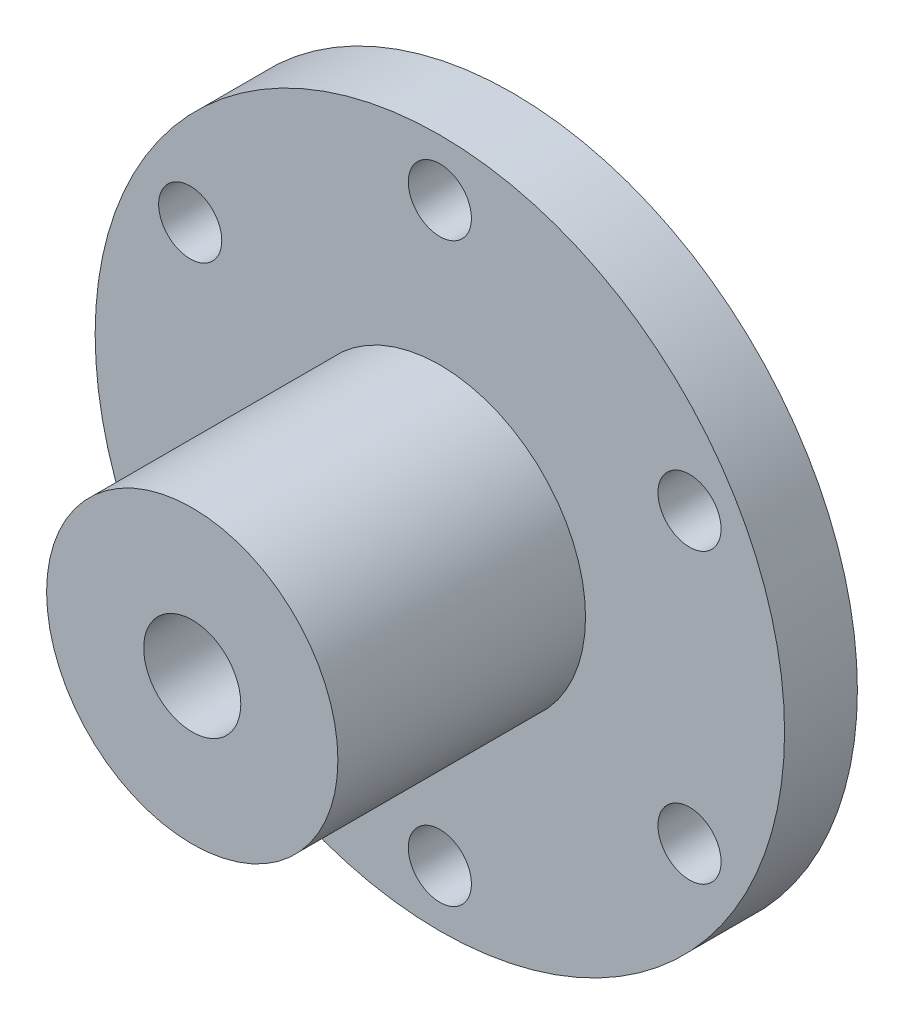
ISO-10303-21;
HEADER;
FILE_DESCRIPTION(('STEP AP214'),'2;1');
FILE_NAME('part.step','',(''),(''),'','','');
FILE_SCHEMA(('AUTOMOTIVE_DESIGN { 1 0 10303 214 1 1 1 1 }'));
ENDSEC;
DATA;
#1=APPLICATION_CONTEXT('core data for automotive mechanical design processes');
#2=APPLICATION_PROTOCOL_DEFINITION('international standard','automotive_design',2000,#1);
#3=PRODUCT_CONTEXT('',#1,'mechanical');
#4=PRODUCT('Part','Part','',(#3));
#5=PRODUCT_RELATED_PRODUCT_CATEGORY('part','',(#4));
#6=PRODUCT_DEFINITION_FORMATION('','',#4);
#7=PRODUCT_DEFINITION_CONTEXT('part definition',#1,'design');
#8=PRODUCT_DEFINITION('design','',#6,#7);
#9=PRODUCT_DEFINITION_SHAPE('','',#8);
#10=(LENGTH_UNIT() NAMED_UNIT(*) SI_UNIT(.MILLI.,.METRE.));
#11=(NAMED_UNIT(*) PLANE_ANGLE_UNIT() SI_UNIT($,.RADIAN.));
#12=(NAMED_UNIT(*) SI_UNIT($,.STERADIAN.) SOLID_ANGLE_UNIT());
#13=UNCERTAINTY_MEASURE_WITH_UNIT(LENGTH_MEASURE(1.E-05),#10,'distance_accuracy_value','');
#14=(GEOMETRIC_REPRESENTATION_CONTEXT(3) GLOBAL_UNCERTAINTY_ASSIGNED_CONTEXT((#13)) GLOBAL_UNIT_ASSIGNED_CONTEXT((#10,
#11,#12)) REPRESENTATION_CONTEXT('',''));
#15=CARTESIAN_POINT('',(0.,0.,0.));
#16=DIRECTION('',(0.,0.,1.));
#17=DIRECTION('',(1.,0.,0.));
#18=AXIS2_PLACEMENT_3D('',#15,#16,#17);
#19=CARTESIAN_POINT('',(0.,0.,6.));
#20=DIRECTION('',(0.,0.,1.));
#21=DIRECTION('',(1.,0.,0.));
#22=AXIS2_PLACEMENT_3D('',#19,#20,#21);
#23=PLANE('',#22);
#24=CARTESIAN_POINT('',(-20.5681033398798,11.8749999999988,6.));
#25=DIRECTION('',(0.,0.,1.));
#26=DIRECTION('',(1.,0.,0.));
#27=AXIS2_PLACEMENT_3D('',#24,#25,#26);
#28=CIRCLE('',#27,2.60000000000127);
#29=CARTESIAN_POINT('',(-17.9681033398785,11.8749999999988,6.));
#30=VERTEX_POINT('',#29);
#31=EDGE_CURVE('E92',#30,#30,#28,.T.);
#32=ORIENTED_EDGE('',*,*,#31,.F.);
#33=EDGE_LOOP('',(#32));
#34=FACE_BOUND('',#33,.T.);
#35=CARTESIAN_POINT('',(2.69133678744446E-12,-23.75,6.));
#36=DIRECTION('',(0.,0.,1.));
#37=DIRECTION('',(1.,0.,0.));
#38=AXIS2_PLACEMENT_3D('',#35,#36,#37);
#39=CIRCLE('',#38,2.60000000000273);
#40=CARTESIAN_POINT('',(2.60000000000542,-23.75,6.));
#41=VERTEX_POINT('',#40);
#42=EDGE_CURVE('E76',#41,#41,#39,.T.);
#43=ORIENTED_EDGE('',*,*,#42,.F.);
#44=EDGE_LOOP('',(#43));
#45=FACE_BOUND('',#44,.T.);
#46=CARTESIAN_POINT('',(20.5681033398811,11.8750000000012,6.));
#47=DIRECTION('',(0.,0.,1.));
#48=DIRECTION('',(1.,0.,0.));
#49=AXIS2_PLACEMENT_3D('',#46,#47,#48);
#50=CIRCLE('',#49,2.60000000000036);
#51=CARTESIAN_POINT('',(23.1681033398814,11.8750000000012,6.));
#52=VERTEX_POINT('',#51);
#53=EDGE_CURVE('E63',#52,#52,#50,.T.);
#54=ORIENTED_EDGE('',*,*,#53,.F.);
#55=EDGE_LOOP('',(#54));
#56=FACE_BOUND('',#55,.T.);
#57=CARTESIAN_POINT('',(0.,23.75,6.));
#58=DIRECTION('',(0.,0.,1.));
#59=DIRECTION('',(1.,0.,0.));
#60=AXIS2_PLACEMENT_3D('',#57,#58,#59);
#61=CIRCLE('',#60,2.6);
#62=CARTESIAN_POINT('',(2.6,23.75,6.));
#63=VERTEX_POINT('',#62);
#64=EDGE_CURVE('E50',#63,#63,#61,.T.);
#65=ORIENTED_EDGE('',*,*,#64,.F.);
#66=EDGE_LOOP('',(#65));
#67=FACE_BOUND('',#66,.T.);
#68=CARTESIAN_POINT('',(0.,0.,6.));
#69=DIRECTION('',(0.,0.,1.));
#70=DIRECTION('',(1.,0.,0.));
#71=AXIS2_PLACEMENT_3D('',#68,#69,#70);
#72=CIRCLE('',#71,28.4);
#73=CARTESIAN_POINT('',(28.4,0.,6.));
#74=VERTEX_POINT('',#73);
#75=EDGE_CURVE('E10',#74,#74,#72,.T.);
#76=ORIENTED_EDGE('',*,*,#75,.T.);
#77=EDGE_LOOP('',(#76));
#78=FACE_BOUND('',#77,.T.);
#79=CARTESIAN_POINT('',(20.5681033398824,-11.8749999999988,6.));
#80=DIRECTION('',(0.,0.,1.));
#81=DIRECTION('',(1.,0.,0.));
#82=AXIS2_PLACEMENT_3D('',#79,#80,#81);
#83=CIRCLE('',#82,2.6000000000017);
#84=CARTESIAN_POINT('',(23.1681033398841,-11.8749999999988,6.));
#85=VERTEX_POINT('',#84);
#86=EDGE_CURVE('E68',#85,#85,#83,.T.);
#87=ORIENTED_EDGE('',*,*,#86,.F.);
#88=EDGE_LOOP('',(#87));
#89=FACE_BOUND('',#88,.T.);
#90=CARTESIAN_POINT('',(-20.5681033398784,-11.8750000000012,6.));
#91=DIRECTION('',(0.,0.,1.));
#92=DIRECTION('',(1.,0.,0.));
#93=AXIS2_PLACEMENT_3D('',#90,#91,#92);
#94=CIRCLE('',#93,2.60000000000249);
#95=CARTESIAN_POINT('',(-17.9681033398759,-11.8750000000012,6.));
#96=VERTEX_POINT('',#95);
#97=EDGE_CURVE('E84',#96,#96,#94,.T.);
#98=ORIENTED_EDGE('',*,*,#97,.F.);
#99=EDGE_LOOP('',(#98));
#100=FACE_BOUND('',#99,.T.);
#101=CARTESIAN_POINT('',(0.,0.,6.));
#102=DIRECTION('',(0.,0.,1.));
#103=DIRECTION('',(1.,0.,0.));
#104=AXIS2_PLACEMENT_3D('',#101,#102,#103);
#105=CIRCLE('',#104,12.);
#106=CARTESIAN_POINT('',(12.,0.,6.));
#107=VERTEX_POINT('',#106);
#108=EDGE_CURVE('E104',#107,#107,#105,.T.);
#109=ORIENTED_EDGE('',*,*,#108,.F.);
#110=EDGE_LOOP('',(#109));
#111=FACE_BOUND('',#110,.T.);
#112=ADVANCED_FACE('F37',(#34,#45,#56,#67,#78,#89,#100,#111),#23,.T.);
#113=CARTESIAN_POINT('',(0.,0.,0.));
#114=DIRECTION('',(0.,0.,1.));
#115=DIRECTION('',(1.,0.,0.));
#116=AXIS2_PLACEMENT_3D('',#113,#114,#115);
#117=PLANE('',#116);
#118=CARTESIAN_POINT('',(0.,0.,0.));
#119=DIRECTION('',(0.,0.,1.));
#120=DIRECTION('',(1.,0.,0.));
#121=AXIS2_PLACEMENT_3D('',#118,#119,#120);
#122=CIRCLE('',#121,28.4);
#123=CARTESIAN_POINT('',(28.4,0.,0.));
#124=VERTEX_POINT('',#123);
#125=EDGE_CURVE('E41',#124,#124,#122,.T.);
#126=ORIENTED_EDGE('',*,*,#125,.F.);
#127=EDGE_LOOP('',(#126));
#128=FACE_BOUND('',#127,.T.);
#129=CARTESIAN_POINT('',(0.,23.75,0.));
#130=DIRECTION('',(0.,0.,1.));
#131=DIRECTION('',(1.,0.,0.));
#132=AXIS2_PLACEMENT_3D('',#129,#130,#131);
#133=CIRCLE('',#132,2.6);
#134=CARTESIAN_POINT('',(2.6,23.75,0.));
#135=VERTEX_POINT('',#134);
#136=EDGE_CURVE('E52',#135,#135,#133,.T.);
#137=ORIENTED_EDGE('',*,*,#136,.T.);
#138=EDGE_LOOP('',(#137));
#139=FACE_BOUND('',#138,.T.);
#140=CARTESIAN_POINT('',(0.,0.,0.));
#141=DIRECTION('',(0.,0.,1.));
#142=DIRECTION('',(1.,0.,0.));
#143=AXIS2_PLACEMENT_3D('',#140,#141,#142);
#144=CIRCLE('',#143,4.);
#145=CARTESIAN_POINT('',(4.,0.,0.));
#146=VERTEX_POINT('',#145);
#147=EDGE_CURVE('E56',#146,#146,#144,.T.);
#148=ORIENTED_EDGE('',*,*,#147,.T.);
#149=EDGE_LOOP('',(#148));
#150=FACE_BOUND('',#149,.T.);
#151=CARTESIAN_POINT('',(20.5681033398811,11.8750000000012,0.));
#152=DIRECTION('',(0.,0.,1.));
#153=DIRECTION('',(1.,0.,0.));
#154=AXIS2_PLACEMENT_3D('',#151,#152,#153);
#155=CIRCLE('',#154,2.60000000000036);
#156=CARTESIAN_POINT('',(23.1681033398814,11.8750000000012,0.));
#157=VERTEX_POINT('',#156);
#158=EDGE_CURVE('E64',#157,#157,#155,.T.);
#159=ORIENTED_EDGE('',*,*,#158,.T.);
#160=EDGE_LOOP('',(#159));
#161=FACE_BOUND('',#160,.T.);
#162=CARTESIAN_POINT('',(20.5681033398824,-11.8749999999988,0.));
#163=DIRECTION('',(0.,0.,1.));
#164=DIRECTION('',(1.,0.,0.));
#165=AXIS2_PLACEMENT_3D('',#162,#163,#164);
#166=CIRCLE('',#165,2.6000000000017);
#167=CARTESIAN_POINT('',(23.1681033398841,-11.8749999999988,0.));
#168=VERTEX_POINT('',#167);
#169=EDGE_CURVE('E72',#168,#168,#166,.T.);
#170=ORIENTED_EDGE('',*,*,#169,.T.);
#171=EDGE_LOOP('',(#170));
#172=FACE_BOUND('',#171,.T.);
#173=CARTESIAN_POINT('',(2.69133678744446E-12,-23.75,0.));
#174=DIRECTION('',(0.,0.,1.));
#175=DIRECTION('',(1.,0.,0.));
#176=AXIS2_PLACEMENT_3D('',#173,#174,#175);
#177=CIRCLE('',#176,2.60000000000273);
#178=CARTESIAN_POINT('',(2.60000000000542,-23.75,0.));
#179=VERTEX_POINT('',#178);
#180=EDGE_CURVE('E80',#179,#179,#177,.T.);
#181=ORIENTED_EDGE('',*,*,#180,.T.);
#182=EDGE_LOOP('',(#181));
#183=FACE_BOUND('',#182,.T.);
#184=CARTESIAN_POINT('',(-20.5681033398784,-11.8750000000012,0.));
#185=DIRECTION('',(0.,0.,1.));
#186=DIRECTION('',(1.,0.,0.));
#187=AXIS2_PLACEMENT_3D('',#184,#185,#186);
#188=CIRCLE('',#187,2.60000000000249);
#189=CARTESIAN_POINT('',(-17.9681033398759,-11.8750000000012,0.));
#190=VERTEX_POINT('',#189);
#191=EDGE_CURVE('E88',#190,#190,#188,.T.);
#192=ORIENTED_EDGE('',*,*,#191,.T.);
#193=EDGE_LOOP('',(#192));
#194=FACE_BOUND('',#193,.T.);
#195=CARTESIAN_POINT('',(-20.5681033398798,11.8749999999988,0.));
#196=DIRECTION('',(0.,0.,1.));
#197=DIRECTION('',(1.,0.,0.));
#198=AXIS2_PLACEMENT_3D('',#195,#196,#197);
#199=CIRCLE('',#198,2.60000000000127);
#200=CARTESIAN_POINT('',(-17.9681033398785,11.8749999999988,0.));
#201=VERTEX_POINT('',#200);
#202=EDGE_CURVE('E96',#201,#201,#199,.T.);
#203=ORIENTED_EDGE('',*,*,#202,.T.);
#204=EDGE_LOOP('',(#203));
#205=FACE_BOUND('',#204,.T.);
#206=ADVANCED_FACE('F134',(#128,#139,#150,#161,#172,#183,#194,#205),#117,.F.);
#207=CARTESIAN_POINT('',(0.,0.,6.));
#208=DIRECTION('',(0.,0.,-1.));
#209=DIRECTION('',(-1.,0.,0.));
#210=AXIS2_PLACEMENT_3D('',#207,#208,#209);
#211=CYLINDRICAL_SURFACE('',#210,28.4);
#212=ORIENTED_EDGE('',*,*,#75,.F.);
#213=EDGE_LOOP('',(#212));
#214=FACE_BOUND('',#213,.T.);
#215=ORIENTED_EDGE('',*,*,#125,.T.);
#216=EDGE_LOOP('',(#215));
#217=FACE_BOUND('',#216,.T.);
#218=ADVANCED_FACE('F39',(#214,#217),#211,.T.);
#219=CARTESIAN_POINT('',(0.,23.75,6.));
#220=DIRECTION('',(0.,0.,-1.));
#221=DIRECTION('',(-1.,0.,0.));
#222=AXIS2_PLACEMENT_3D('',#219,#220,#221);
#223=CYLINDRICAL_SURFACE('',#222,2.6);
#224=ORIENTED_EDGE('',*,*,#64,.T.);
#225=EDGE_LOOP('',(#224));
#226=FACE_BOUND('',#225,.T.);
#227=ORIENTED_EDGE('',*,*,#136,.F.);
#228=EDGE_LOOP('',(#227));
#229=FACE_BOUND('',#228,.T.);
#230=ADVANCED_FACE('F144',(#226,#229),#223,.F.);
#231=CARTESIAN_POINT('',(0.,0.,6.));
#232=DIRECTION('',(0.,0.,-1.));
#233=DIRECTION('',(-1.,0.,0.));
#234=AXIS2_PLACEMENT_3D('',#231,#232,#233);
#235=CYLINDRICAL_SURFACE('',#234,4.);
#236=ORIENTED_EDGE('',*,*,#147,.F.);
#237=EDGE_LOOP('',(#236));
#238=FACE_BOUND('',#237,.T.);
#239=CARTESIAN_POINT('',(0.,0.,26.4));
#240=DIRECTION('',(0.,0.,1.));
#241=DIRECTION('',(1.,0.,0.));
#242=AXIS2_PLACEMENT_3D('',#239,#240,#241);
#243=CIRCLE('',#242,4.);
#244=CARTESIAN_POINT('',(4.,0.,26.4));
#245=VERTEX_POINT('',#244);
#246=EDGE_CURVE('E108',#245,#245,#243,.T.);
#247=ORIENTED_EDGE('',*,*,#246,.T.);
#248=EDGE_LOOP('',(#247));
#249=FACE_BOUND('',#248,.T.);
#250=ADVANCED_FACE('F116',(#238,#249),#235,.F.);
#251=CARTESIAN_POINT('',(20.5681033398811,11.8750000000012,6.));
#252=DIRECTION('',(0.,0.,-1.));
#253=DIRECTION('',(-1.,0.,0.));
#254=AXIS2_PLACEMENT_3D('',#251,#252,#253);
#255=CYLINDRICAL_SURFACE('',#254,2.60000000000036);
#256=ORIENTED_EDGE('',*,*,#53,.T.);
#257=EDGE_LOOP('',(#256));
#258=FACE_BOUND('',#257,.T.);
#259=ORIENTED_EDGE('',*,*,#158,.F.);
#260=EDGE_LOOP('',(#259));
#261=FACE_BOUND('',#260,.T.);
#262=ADVANCED_FACE('F150',(#258,#261),#255,.F.);
#263=CARTESIAN_POINT('',(20.5681033398824,-11.8749999999988,6.));
#264=DIRECTION('',(0.,0.,-1.));
#265=DIRECTION('',(-1.,0.,0.));
#266=AXIS2_PLACEMENT_3D('',#263,#264,#265);
#267=CYLINDRICAL_SURFACE('',#266,2.6000000000017);
#268=ORIENTED_EDGE('',*,*,#86,.T.);
#269=EDGE_LOOP('',(#268));
#270=FACE_BOUND('',#269,.T.);
#271=ORIENTED_EDGE('',*,*,#169,.F.);
#272=EDGE_LOOP('',(#271));
#273=FACE_BOUND('',#272,.T.);
#274=ADVANCED_FACE('F154',(#270,#273),#267,.F.);
#275=CARTESIAN_POINT('',(2.69133678744446E-12,-23.75,6.));
#276=DIRECTION('',(0.,0.,-1.));
#277=DIRECTION('',(-1.,0.,0.));
#278=AXIS2_PLACEMENT_3D('',#275,#276,#277);
#279=CYLINDRICAL_SURFACE('',#278,2.60000000000273);
#280=ORIENTED_EDGE('',*,*,#42,.T.);
#281=EDGE_LOOP('',(#280));
#282=FACE_BOUND('',#281,.T.);
#283=ORIENTED_EDGE('',*,*,#180,.F.);
#284=EDGE_LOOP('',(#283));
#285=FACE_BOUND('',#284,.T.);
#286=ADVANCED_FACE('F158',(#282,#285),#279,.F.);
#287=CARTESIAN_POINT('',(-20.5681033398784,-11.8750000000012,6.));
#288=DIRECTION('',(0.,0.,-1.));
#289=DIRECTION('',(-1.,0.,0.));
#290=AXIS2_PLACEMENT_3D('',#287,#288,#289);
#291=CYLINDRICAL_SURFACE('',#290,2.60000000000249);
#292=ORIENTED_EDGE('',*,*,#97,.T.);
#293=EDGE_LOOP('',(#292));
#294=FACE_BOUND('',#293,.T.);
#295=ORIENTED_EDGE('',*,*,#191,.F.);
#296=EDGE_LOOP('',(#295));
#297=FACE_BOUND('',#296,.T.);
#298=ADVANCED_FACE('F130',(#294,#297),#291,.F.);
#299=CARTESIAN_POINT('',(-20.5681033398798,11.8749999999988,6.));
#300=DIRECTION('',(0.,0.,-1.));
#301=DIRECTION('',(-1.,0.,0.));
#302=AXIS2_PLACEMENT_3D('',#299,#300,#301);
#303=CYLINDRICAL_SURFACE('',#302,2.60000000000127);
#304=ORIENTED_EDGE('',*,*,#31,.T.);
#305=EDGE_LOOP('',(#304));
#306=FACE_BOUND('',#305,.T.);
#307=ORIENTED_EDGE('',*,*,#202,.F.);
#308=EDGE_LOOP('',(#307));
#309=FACE_BOUND('',#308,.T.);
#310=ADVANCED_FACE('F121',(#306,#309),#303,.F.);
#311=CARTESIAN_POINT('',(0.,0.,26.4));
#312=DIRECTION('',(0.,0.,1.));
#313=DIRECTION('',(1.,0.,0.));
#314=AXIS2_PLACEMENT_3D('',#311,#312,#313);
#315=PLANE('',#314);
#316=CARTESIAN_POINT('',(0.,0.,26.4));
#317=DIRECTION('',(0.,0.,1.));
#318=DIRECTION('',(1.,0.,0.));
#319=AXIS2_PLACEMENT_3D('',#316,#317,#318);
#320=CIRCLE('',#319,12.);
#321=CARTESIAN_POINT('',(12.,0.,26.4));
#322=VERTEX_POINT('',#321);
#323=EDGE_CURVE('E100',#322,#322,#320,.T.);
#324=ORIENTED_EDGE('',*,*,#323,.T.);
#325=EDGE_LOOP('',(#324));
#326=FACE_BOUND('',#325,.T.);
#327=ORIENTED_EDGE('',*,*,#246,.F.);
#328=EDGE_LOOP('',(#327));
#329=FACE_BOUND('',#328,.T.);
#330=ADVANCED_FACE('F118',(#326,#329),#315,.T.);
#331=CARTESIAN_POINT('',(0.,0.,26.4));
#332=DIRECTION('',(0.,0.,-1.));
#333=DIRECTION('',(-1.,0.,0.));
#334=AXIS2_PLACEMENT_3D('',#331,#332,#333);
#335=CYLINDRICAL_SURFACE('',#334,12.);
#336=ORIENTED_EDGE('',*,*,#323,.F.);
#337=EDGE_LOOP('',(#336));
#338=FACE_BOUND('',#337,.T.);
#339=ORIENTED_EDGE('',*,*,#108,.T.);
#340=EDGE_LOOP('',(#339));
#341=FACE_BOUND('',#340,.T.);
#342=ADVANCED_FACE('F120',(#338,#341),#335,.T.);
#343=CLOSED_SHELL('',(#112,#206,#218,#230,#250,#262,#274,#286,#298,#310,#330,#342));
#344=MANIFOLD_SOLID_BREP('B2',#343);
#345=ADVANCED_BREP_SHAPE_REPRESENTATION('',(#18,#344),#14);
#346=SHAPE_DEFINITION_REPRESENTATION(#9,#345);
ENDSEC;
END-ISO-10303-21;
